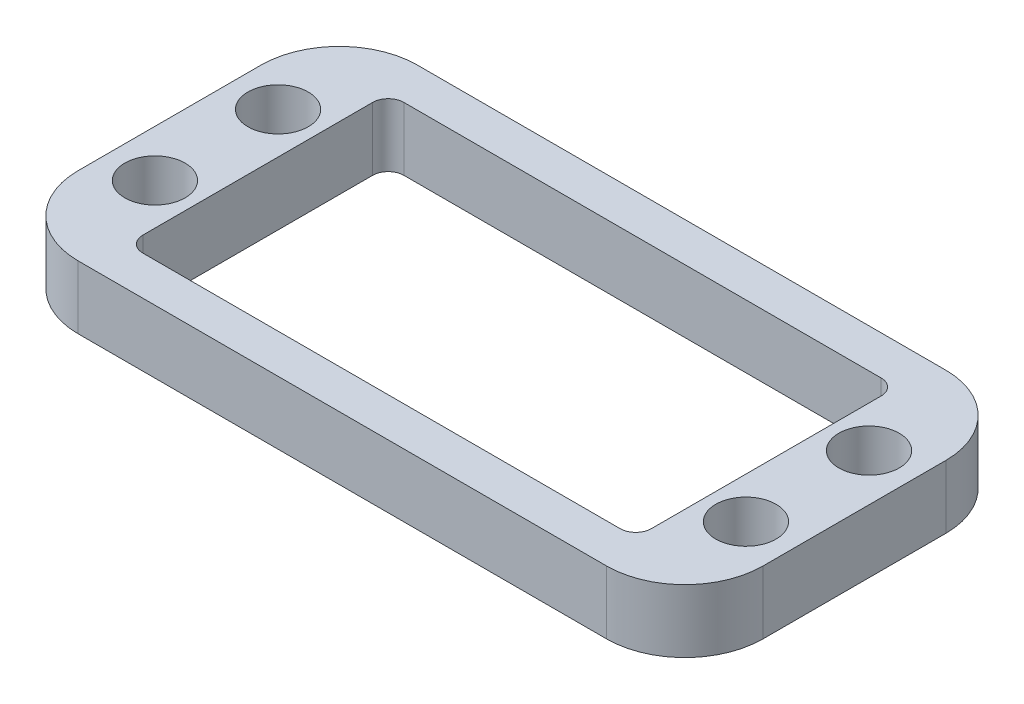
ISO-10303-21;
HEADER;
FILE_DESCRIPTION(('STEP AP214'),'2;1');
FILE_NAME('part.step','',(''),(''),'','','');
FILE_SCHEMA(('AUTOMOTIVE_DESIGN { 1 0 10303 214 1 1 1 1 }'));
ENDSEC;
DATA;
#1=APPLICATION_CONTEXT('core data for automotive mechanical design processes');
#2=APPLICATION_PROTOCOL_DEFINITION('international standard','automotive_design',2000,#1);
#3=PRODUCT_CONTEXT('',#1,'mechanical');
#4=PRODUCT('Part','Part','',(#3));
#5=PRODUCT_RELATED_PRODUCT_CATEGORY('part','',(#4));
#6=PRODUCT_DEFINITION_FORMATION('','',#4);
#7=PRODUCT_DEFINITION_CONTEXT('part definition',#1,'design');
#8=PRODUCT_DEFINITION('design','',#6,#7);
#9=PRODUCT_DEFINITION_SHAPE('','',#8);
#10=(LENGTH_UNIT() NAMED_UNIT(*) SI_UNIT(.MILLI.,.METRE.));
#11=(NAMED_UNIT(*) PLANE_ANGLE_UNIT() SI_UNIT($,.RADIAN.));
#12=(NAMED_UNIT(*) SI_UNIT($,.STERADIAN.) SOLID_ANGLE_UNIT());
#13=UNCERTAINTY_MEASURE_WITH_UNIT(LENGTH_MEASURE(1.E-05),#10,'distance_accuracy_value','');
#14=(GEOMETRIC_REPRESENTATION_CONTEXT(3) GLOBAL_UNCERTAINTY_ASSIGNED_CONTEXT((#13)) GLOBAL_UNIT_ASSIGNED_CONTEXT((#10,
#11,#12)) REPRESENTATION_CONTEXT('',''));
#15=CARTESIAN_POINT('',(0.,0.,0.));
#16=DIRECTION('',(0.,0.,1.));
#17=DIRECTION('',(1.,0.,0.));
#18=AXIS2_PLACEMENT_3D('',#15,#16,#17);
#19=CARTESIAN_POINT('',(0.,5.1308,0.));
#20=DIRECTION('',(0.,1.,0.));
#21=DIRECTION('',(0.,0.,1.));
#22=AXIS2_PLACEMENT_3D('',#19,#20,#21);
#23=PLANE('',#22);
#24=CARTESIAN_POINT('',(24.,5.1308,5.));
#25=DIRECTION('',(0.,1.,0.));
#26=DIRECTION('',(0.,0.,1.));
#27=AXIS2_PLACEMENT_3D('',#24,#25,#26);
#28=CIRCLE('',#27,2.45);
#29=CARTESIAN_POINT('',(24.,5.1308,7.45));
#30=VERTEX_POINT('',#29);
#31=EDGE_CURVE('E532',#30,#30,#28,.T.);
#32=ORIENTED_EDGE('',*,*,#31,.F.);
#33=EDGE_LOOP('',(#32));
#34=FACE_BOUND('',#33,.T.);
#35=CARTESIAN_POINT('',(-24.,5.1308,-5.));
#36=DIRECTION('',(0.,1.,0.));
#37=DIRECTION('',(0.,0.,1.));
#38=AXIS2_PLACEMENT_3D('',#35,#36,#37);
#39=CIRCLE('',#38,2.45);
#40=CARTESIAN_POINT('',(-24.,5.1308,-2.55));
#41=VERTEX_POINT('',#40);
#42=EDGE_CURVE('E534',#41,#41,#39,.T.);
#43=ORIENTED_EDGE('',*,*,#42,.F.);
#44=EDGE_LOOP('',(#43));
#45=FACE_BOUND('',#44,.T.);
#46=CARTESIAN_POINT('',(-24.,5.1308,5.));
#47=DIRECTION('',(0.,1.,0.));
#48=DIRECTION('',(0.,0.,1.));
#49=AXIS2_PLACEMENT_3D('',#46,#47,#48);
#50=CIRCLE('',#49,2.45);
#51=CARTESIAN_POINT('',(-24.,5.1308,7.45));
#52=VERTEX_POINT('',#51);
#53=EDGE_CURVE('E542',#52,#52,#50,.T.);
#54=ORIENTED_EDGE('',*,*,#53,.F.);
#55=EDGE_LOOP('',(#54));
#56=FACE_BOUND('',#55,.T.);
#57=CARTESIAN_POINT('',(24.,5.1308,-5.));
#58=DIRECTION('',(0.,1.,0.));
#59=DIRECTION('',(0.,0.,1.));
#60=AXIS2_PLACEMENT_3D('',#57,#58,#59);
#61=CIRCLE('',#60,2.45);
#62=CARTESIAN_POINT('',(24.,5.1308,-2.55));
#63=VERTEX_POINT('',#62);
#64=EDGE_CURVE('E548',#63,#63,#61,.T.);
#65=ORIENTED_EDGE('',*,*,#64,.F.);
#66=EDGE_LOOP('',(#65));
#67=FACE_BOUND('',#66,.T.);
#68=DIRECTION('',(1.,0.,0.));
#69=VECTOR('',#68,1.);
#70=CARTESIAN_POINT('',(-27.810000006,5.1308,13.775000009));
#71=LINE('',#70,#69);
#72=CARTESIAN_POINT('',(-21.460000006,5.1308,13.775000009));
#73=VERTEX_POINT('',#72);
#74=CARTESIAN_POINT('',(21.460000006,5.1308,13.775000009));
#75=VERTEX_POINT('',#74);
#76=EDGE_CURVE('E188',#73,#75,#71,.T.);
#77=ORIENTED_EDGE('',*,*,#76,.T.);
#78=CARTESIAN_POINT('',(21.460000006,5.1308,7.425000009));
#79=DIRECTION('',(0.,1.,0.));
#80=DIRECTION('',(0.,0.,1.));
#81=AXIS2_PLACEMENT_3D('',#78,#79,#80);
#82=CIRCLE('',#81,6.35);
#83=CARTESIAN_POINT('',(27.810000006,5.1308,7.425000009));
#84=VERTEX_POINT('',#83);
#85=EDGE_CURVE('E209',#75,#84,#82,.T.);
#86=ORIENTED_EDGE('',*,*,#85,.T.);
#87=DIRECTION('',(0.,0.,-1.));
#88=VECTOR('',#87,1.);
#89=CARTESIAN_POINT('',(27.810000006,5.1308,-13.775000009));
#90=LINE('',#89,#88);
#91=CARTESIAN_POINT('',(27.810000006,5.1308,-7.425000009));
#92=VERTEX_POINT('',#91);
#93=EDGE_CURVE('E171',#84,#92,#90,.T.);
#94=ORIENTED_EDGE('',*,*,#93,.T.);
#95=CARTESIAN_POINT('',(21.460000006,5.1308,-7.425000009));
#96=DIRECTION('',(0.,1.,0.));
#97=DIRECTION('',(0.,0.,1.));
#98=AXIS2_PLACEMENT_3D('',#95,#96,#97);
#99=CIRCLE('',#98,6.35);
#100=CARTESIAN_POINT('',(21.460000006,5.1308,-13.775000009));
#101=VERTEX_POINT('',#100);
#102=EDGE_CURVE('E207',#92,#101,#99,.T.);
#103=ORIENTED_EDGE('',*,*,#102,.T.);
#104=DIRECTION('',(-1.,0.,0.));
#105=VECTOR('',#104,1.);
#106=CARTESIAN_POINT('',(-27.810000006,5.1308,-13.775000009));
#107=LINE('',#106,#105);
#108=CARTESIAN_POINT('',(-21.460000006,5.1308,-13.775000009));
#109=VERTEX_POINT('',#108);
#110=EDGE_CURVE('E283',#101,#109,#107,.T.);
#111=ORIENTED_EDGE('',*,*,#110,.T.);
#112=CARTESIAN_POINT('',(-21.460000006,5.1308,-7.425000009));
#113=DIRECTION('',(0.,1.,0.));
#114=DIRECTION('',(0.,0.,1.));
#115=AXIS2_PLACEMENT_3D('',#112,#113,#114);
#116=CIRCLE('',#115,6.35);
#117=CARTESIAN_POINT('',(-27.810000006,5.1308,-7.425000009));
#118=VERTEX_POINT('',#117);
#119=EDGE_CURVE('E203',#109,#118,#116,.T.);
#120=ORIENTED_EDGE('',*,*,#119,.T.);
#121=DIRECTION('',(0.,0.,1.));
#122=VECTOR('',#121,1.);
#123=CARTESIAN_POINT('',(-27.810000006,5.1308,-13.775000009));
#124=LINE('',#123,#122);
#125=CARTESIAN_POINT('',(-27.810000006,5.1308,7.425000009));
#126=VERTEX_POINT('',#125);
#127=EDGE_CURVE('E285',#118,#126,#124,.T.);
#128=ORIENTED_EDGE('',*,*,#127,.T.);
#129=CARTESIAN_POINT('',(-21.460000006,5.1308,7.425000009));
#130=DIRECTION('',(0.,1.,0.));
#131=DIRECTION('',(0.,0.,1.));
#132=AXIS2_PLACEMENT_3D('',#129,#130,#131);
#133=CIRCLE('',#132,6.35);
#134=EDGE_CURVE('E205',#126,#73,#133,.T.);
#135=ORIENTED_EDGE('',*,*,#134,.T.);
#136=EDGE_LOOP('',(#77,#86,#94,#103,#111,#120,#128,#135));
#137=FACE_BOUND('',#136,.T.);
#138=DIRECTION('',(-1.,0.,0.));
#139=VECTOR('',#138,1.);
#140=CARTESIAN_POINT('',(-20.649999975,5.1308,-10.600000009));
#141=LINE('',#140,#139);
#142=CARTESIAN_POINT('',(19.379999975,5.1308,-10.600000009));
#143=VERTEX_POINT('',#142);
#144=CARTESIAN_POINT('',(-19.379999975,5.1308,-10.600000009));
#145=VERTEX_POINT('',#144);
#146=EDGE_CURVE('E267',#143,#145,#141,.T.);
#147=ORIENTED_EDGE('',*,*,#146,.F.);
#148=CARTESIAN_POINT('',(19.379999975,5.1308,-9.330000009));
#149=DIRECTION('',(0.,1.,0.));
#150=DIRECTION('',(0.,0.,1.));
#151=AXIS2_PLACEMENT_3D('',#148,#149,#150);
#152=CIRCLE('',#151,1.27);
#153=CARTESIAN_POINT('',(20.649999975,5.1308,-9.330000009));
#154=VERTEX_POINT('',#153);
#155=EDGE_CURVE('E250',#143,#154,#152,.F.);
#156=ORIENTED_EDGE('',*,*,#155,.T.);
#157=DIRECTION('',(0.,0.,-1.));
#158=VECTOR('',#157,1.);
#159=CARTESIAN_POINT('',(20.649999975,5.1308,-10.600000009));
#160=LINE('',#159,#158);
#161=CARTESIAN_POINT('',(20.649999975,5.1308,9.330000009));
#162=VERTEX_POINT('',#161);
#163=EDGE_CURVE('E269',#162,#154,#160,.T.);
#164=ORIENTED_EDGE('',*,*,#163,.F.);
#165=CARTESIAN_POINT('',(19.379999975,5.1308,9.330000009));
#166=DIRECTION('',(0.,1.,0.));
#167=DIRECTION('',(0.,0.,1.));
#168=AXIS2_PLACEMENT_3D('',#165,#166,#167);
#169=CIRCLE('',#168,1.27);
#170=CARTESIAN_POINT('',(19.379999975,5.1308,10.600000009));
#171=VERTEX_POINT('',#170);
#172=EDGE_CURVE('E246',#162,#171,#169,.F.);
#173=ORIENTED_EDGE('',*,*,#172,.T.);
#174=DIRECTION('',(1.,0.,0.));
#175=VECTOR('',#174,1.);
#176=CARTESIAN_POINT('',(-20.649999975,5.1308,10.600000009));
#177=LINE('',#176,#175);
#178=CARTESIAN_POINT('',(-19.379999975,5.1308,10.600000009));
#179=VERTEX_POINT('',#178);
#180=EDGE_CURVE('E179',#179,#171,#177,.T.);
#181=ORIENTED_EDGE('',*,*,#180,.F.);
#182=CARTESIAN_POINT('',(-19.379999975,5.1308,9.330000009));
#183=DIRECTION('',(0.,1.,0.));
#184=DIRECTION('',(0.,0.,1.));
#185=AXIS2_PLACEMENT_3D('',#182,#183,#184);
#186=CIRCLE('',#185,1.27);
#187=CARTESIAN_POINT('',(-20.649999975,5.1308,9.330000009));
#188=VERTEX_POINT('',#187);
#189=EDGE_CURVE('E242',#179,#188,#186,.F.);
#190=ORIENTED_EDGE('',*,*,#189,.T.);
#191=DIRECTION('',(0.,0.,1.));
#192=VECTOR('',#191,1.);
#193=CARTESIAN_POINT('',(-20.649999975,5.1308,-10.600000009));
#194=LINE('',#193,#192);
#195=CARTESIAN_POINT('',(-20.649999975,5.1308,-9.330000009));
#196=VERTEX_POINT('',#195);
#197=EDGE_CURVE('E185',#196,#188,#194,.T.);
#198=ORIENTED_EDGE('',*,*,#197,.F.);
#199=CARTESIAN_POINT('',(-19.379999975,5.1308,-9.330000009));
#200=DIRECTION('',(0.,1.,0.));
#201=DIRECTION('',(0.,0.,1.));
#202=AXIS2_PLACEMENT_3D('',#199,#200,#201);
#203=CIRCLE('',#202,1.27);
#204=EDGE_CURVE('E11',#196,#145,#203,.F.);
#205=ORIENTED_EDGE('',*,*,#204,.T.);
#206=EDGE_LOOP('',(#147,#156,#164,#173,#181,#190,#198,#205));
#207=FACE_BOUND('',#206,.T.);
#208=ADVANCED_FACE('F38',(#34,#45,#56,#67,#137,#207),#23,.T.);
#209=CARTESIAN_POINT('',(0.,0.,0.));
#210=DIRECTION('',(0.,1.,0.));
#211=DIRECTION('',(0.,0.,1.));
#212=AXIS2_PLACEMENT_3D('',#209,#210,#211);
#213=PLANE('',#212);
#214=CARTESIAN_POINT('',(24.,0.,5.));
#215=DIRECTION('',(0.,1.,0.));
#216=DIRECTION('',(0.,0.,1.));
#217=AXIS2_PLACEMENT_3D('',#214,#215,#216);
#218=CIRCLE('',#217,2.45);
#219=CARTESIAN_POINT('',(24.,0.,7.45));
#220=VERTEX_POINT('',#219);
#221=EDGE_CURVE('E530',#220,#220,#218,.T.);
#222=ORIENTED_EDGE('',*,*,#221,.T.);
#223=EDGE_LOOP('',(#222));
#224=FACE_BOUND('',#223,.T.);
#225=CARTESIAN_POINT('',(-24.,0.,-5.));
#226=DIRECTION('',(0.,1.,0.));
#227=DIRECTION('',(0.,0.,1.));
#228=AXIS2_PLACEMENT_3D('',#225,#226,#227);
#229=CIRCLE('',#228,2.45);
#230=CARTESIAN_POINT('',(-24.,0.,-2.55));
#231=VERTEX_POINT('',#230);
#232=EDGE_CURVE('E539',#231,#231,#229,.T.);
#233=ORIENTED_EDGE('',*,*,#232,.T.);
#234=EDGE_LOOP('',(#233));
#235=FACE_BOUND('',#234,.T.);
#236=CARTESIAN_POINT('',(-24.,0.,5.));
#237=DIRECTION('',(0.,1.,0.));
#238=DIRECTION('',(0.,0.,1.));
#239=AXIS2_PLACEMENT_3D('',#236,#237,#238);
#240=CIRCLE('',#239,2.45);
#241=CARTESIAN_POINT('',(-24.,0.,7.45));
#242=VERTEX_POINT('',#241);
#243=EDGE_CURVE('E545',#242,#242,#240,.T.);
#244=ORIENTED_EDGE('',*,*,#243,.T.);
#245=EDGE_LOOP('',(#244));
#246=FACE_BOUND('',#245,.T.);
#247=CARTESIAN_POINT('',(24.,0.,-5.));
#248=DIRECTION('',(0.,1.,0.));
#249=DIRECTION('',(0.,0.,1.));
#250=AXIS2_PLACEMENT_3D('',#247,#248,#249);
#251=CIRCLE('',#250,2.45);
#252=CARTESIAN_POINT('',(24.,0.,-2.55));
#253=VERTEX_POINT('',#252);
#254=EDGE_CURVE('E279',#253,#253,#251,.T.);
#255=ORIENTED_EDGE('',*,*,#254,.T.);
#256=EDGE_LOOP('',(#255));
#257=FACE_BOUND('',#256,.T.);
#258=DIRECTION('',(0.,0.,-1.));
#259=VECTOR('',#258,1.);
#260=CARTESIAN_POINT('',(27.810000006,0.,-13.775000009));
#261=LINE('',#260,#259);
#262=CARTESIAN_POINT('',(27.810000006,0.,7.425000009));
#263=VERTEX_POINT('',#262);
#264=CARTESIAN_POINT('',(27.810000006,0.,-7.425000009));
#265=VERTEX_POINT('',#264);
#266=EDGE_CURVE('E168',#263,#265,#261,.T.);
#267=ORIENTED_EDGE('',*,*,#266,.F.);
#268=CARTESIAN_POINT('',(21.460000006,0.,7.425000009));
#269=DIRECTION('',(0.,1.,0.));
#270=DIRECTION('',(0.,0.,1.));
#271=AXIS2_PLACEMENT_3D('',#268,#269,#270);
#272=CIRCLE('',#271,6.35);
#273=CARTESIAN_POINT('',(21.460000006,0.,13.775000009));
#274=VERTEX_POINT('',#273);
#275=EDGE_CURVE('E151',#263,#274,#272,.F.);
#276=ORIENTED_EDGE('',*,*,#275,.T.);
#277=DIRECTION('',(1.,0.,0.));
#278=VECTOR('',#277,1.);
#279=CARTESIAN_POINT('',(-27.810000006,0.,13.775000009));
#280=LINE('',#279,#278);
#281=CARTESIAN_POINT('',(-21.460000006,0.,13.775000009));
#282=VERTEX_POINT('',#281);
#283=EDGE_CURVE('E193',#282,#274,#280,.T.);
#284=ORIENTED_EDGE('',*,*,#283,.F.);
#285=CARTESIAN_POINT('',(-21.460000006,0.,7.425000009));
#286=DIRECTION('',(0.,1.,0.));
#287=DIRECTION('',(0.,0.,1.));
#288=AXIS2_PLACEMENT_3D('',#285,#286,#287);
#289=CIRCLE('',#288,6.35);
#290=CARTESIAN_POINT('',(-27.810000006,0.,7.425000009));
#291=VERTEX_POINT('',#290);
#292=EDGE_CURVE('E197',#282,#291,#289,.F.);
#293=ORIENTED_EDGE('',*,*,#292,.T.);
#294=DIRECTION('',(0.,0.,1.));
#295=VECTOR('',#294,1.);
#296=CARTESIAN_POINT('',(-27.810000006,0.,-13.775000009));
#297=LINE('',#296,#295);
#298=CARTESIAN_POINT('',(-27.810000006,0.,-7.425000009));
#299=VERTEX_POINT('',#298);
#300=EDGE_CURVE('E182',#299,#291,#297,.T.);
#301=ORIENTED_EDGE('',*,*,#300,.F.);
#302=CARTESIAN_POINT('',(-21.460000006,0.,-7.425000009));
#303=DIRECTION('',(0.,1.,0.));
#304=DIRECTION('',(0.,0.,1.));
#305=AXIS2_PLACEMENT_3D('',#302,#303,#304);
#306=CIRCLE('',#305,6.35);
#307=CARTESIAN_POINT('',(-21.460000006,0.,-13.775000009));
#308=VERTEX_POINT('',#307);
#309=EDGE_CURVE('E172',#299,#308,#306,.F.);
#310=ORIENTED_EDGE('',*,*,#309,.T.);
#311=DIRECTION('',(-1.,0.,0.));
#312=VECTOR('',#311,1.);
#313=CARTESIAN_POINT('',(-27.810000006,0.,-13.775000009));
#314=LINE('',#313,#312);
#315=CARTESIAN_POINT('',(21.460000006,0.,-13.775000009));
#316=VERTEX_POINT('',#315);
#317=EDGE_CURVE('E178',#316,#308,#314,.T.);
#318=ORIENTED_EDGE('',*,*,#317,.F.);
#319=CARTESIAN_POINT('',(21.460000006,0.,-7.425000009));
#320=DIRECTION('',(0.,1.,0.));
#321=DIRECTION('',(0.,0.,1.));
#322=AXIS2_PLACEMENT_3D('',#319,#320,#321);
#323=CIRCLE('',#322,6.35);
#324=EDGE_CURVE('E162',#316,#265,#323,.F.);
#325=ORIENTED_EDGE('',*,*,#324,.T.);
#326=EDGE_LOOP('',(#267,#276,#284,#293,#301,#310,#318,#325));
#327=FACE_BOUND('',#326,.T.);
#328=DIRECTION('',(1.,0.,0.));
#329=VECTOR('',#328,1.);
#330=CARTESIAN_POINT('',(-20.649999975,0.,10.600000009));
#331=LINE('',#330,#329);
#332=CARTESIAN_POINT('',(-19.379999975,0.,10.600000009));
#333=VERTEX_POINT('',#332);
#334=CARTESIAN_POINT('',(19.379999975,0.,10.600000009));
#335=VERTEX_POINT('',#334);
#336=EDGE_CURVE('E264',#333,#335,#331,.T.);
#337=ORIENTED_EDGE('',*,*,#336,.T.);
#338=CARTESIAN_POINT('',(19.379999975,0.,9.330000009));
#339=DIRECTION('',(0.,1.,0.));
#340=DIRECTION('',(0.,0.,1.));
#341=AXIS2_PLACEMENT_3D('',#338,#339,#340);
#342=CIRCLE('',#341,1.27);
#343=CARTESIAN_POINT('',(20.649999975,0.,9.330000009));
#344=VERTEX_POINT('',#343);
#345=EDGE_CURVE('E244',#335,#344,#342,.T.);
#346=ORIENTED_EDGE('',*,*,#345,.T.);
#347=DIRECTION('',(0.,0.,-1.));
#348=VECTOR('',#347,1.);
#349=CARTESIAN_POINT('',(20.649999975,0.,-10.600000009));
#350=LINE('',#349,#348);
#351=CARTESIAN_POINT('',(20.649999975,0.,-9.330000009));
#352=VERTEX_POINT('',#351);
#353=EDGE_CURVE('E276',#344,#352,#350,.T.);
#354=ORIENTED_EDGE('',*,*,#353,.T.);
#355=CARTESIAN_POINT('',(19.379999975,0.,-9.330000009));
#356=DIRECTION('',(0.,1.,0.));
#357=DIRECTION('',(0.,0.,1.));
#358=AXIS2_PLACEMENT_3D('',#355,#356,#357);
#359=CIRCLE('',#358,1.27);
#360=CARTESIAN_POINT('',(19.379999975,0.,-10.600000009));
#361=VERTEX_POINT('',#360);
#362=EDGE_CURVE('E248',#352,#361,#359,.T.);
#363=ORIENTED_EDGE('',*,*,#362,.T.);
#364=DIRECTION('',(-1.,0.,0.));
#365=VECTOR('',#364,1.);
#366=CARTESIAN_POINT('',(-20.649999975,0.,-10.600000009));
#367=LINE('',#366,#365);
#368=CARTESIAN_POINT('',(-19.379999975,0.,-10.600000009));
#369=VERTEX_POINT('',#368);
#370=EDGE_CURVE('E256',#361,#369,#367,.T.);
#371=ORIENTED_EDGE('',*,*,#370,.T.);
#372=CARTESIAN_POINT('',(-19.379999975,0.,-9.330000009));
#373=DIRECTION('',(0.,1.,0.));
#374=DIRECTION('',(0.,0.,1.));
#375=AXIS2_PLACEMENT_3D('',#372,#373,#374);
#376=CIRCLE('',#375,1.27);
#377=CARTESIAN_POINT('',(-20.649999975,0.,-9.330000009));
#378=VERTEX_POINT('',#377);
#379=EDGE_CURVE('E46',#369,#378,#376,.T.);
#380=ORIENTED_EDGE('',*,*,#379,.T.);
#381=DIRECTION('',(0.,0.,1.));
#382=VECTOR('',#381,1.);
#383=CARTESIAN_POINT('',(-20.649999975,0.,-10.600000009));
#384=LINE('',#383,#382);
#385=CARTESIAN_POINT('',(-20.649999975,0.,9.330000009));
#386=VERTEX_POINT('',#385);
#387=EDGE_CURVE('E255',#378,#386,#384,.T.);
#388=ORIENTED_EDGE('',*,*,#387,.T.);
#389=CARTESIAN_POINT('',(-19.379999975,0.,9.330000009));
#390=DIRECTION('',(0.,1.,0.));
#391=DIRECTION('',(0.,0.,1.));
#392=AXIS2_PLACEMENT_3D('',#389,#390,#391);
#393=CIRCLE('',#392,1.27);
#394=EDGE_CURVE('E240',#386,#333,#393,.T.);
#395=ORIENTED_EDGE('',*,*,#394,.T.);
#396=EDGE_LOOP('',(#337,#346,#354,#363,#371,#380,#388,#395));
#397=FACE_BOUND('',#396,.T.);
#398=ADVANCED_FACE('F175',(#224,#235,#246,#257,#327,#397),#213,.F.);
#399=CARTESIAN_POINT('',(27.810000006,5.1308,-13.775000009));
#400=DIRECTION('',(-1.,0.,0.));
#401=DIRECTION('',(0.,0.,1.));
#402=AXIS2_PLACEMENT_3D('',#399,#400,#401);
#403=PLANE('',#402);
#404=ORIENTED_EDGE('',*,*,#93,.F.);
#405=DIRECTION('',(0.,-1.,0.));
#406=VECTOR('',#405,1.);
#407=CARTESIAN_POINT('',(27.810000006,5.1308,7.425000009));
#408=LINE('',#407,#406);
#409=EDGE_CURVE('E155',#84,#263,#408,.T.);
#410=ORIENTED_EDGE('',*,*,#409,.T.);
#411=ORIENTED_EDGE('',*,*,#266,.T.);
#412=DIRECTION('',(0.,-1.,0.));
#413=VECTOR('',#412,1.);
#414=CARTESIAN_POINT('',(27.810000006,5.1308,-7.425000009));
#415=LINE('',#414,#413);
#416=EDGE_CURVE('E173',#265,#92,#415,.F.);
#417=ORIENTED_EDGE('',*,*,#416,.T.);
#418=EDGE_LOOP('',(#404,#410,#411,#417));
#419=FACE_BOUND('',#418,.T.);
#420=ADVANCED_FACE('F167',(#419),#403,.F.);
#421=CARTESIAN_POINT('',(-27.810000006,5.1308,-13.775000009));
#422=DIRECTION('',(0.,0.,1.));
#423=DIRECTION('',(1.,0.,0.));
#424=AXIS2_PLACEMENT_3D('',#421,#422,#423);
#425=PLANE('',#424);
#426=ORIENTED_EDGE('',*,*,#110,.F.);
#427=DIRECTION('',(0.,-1.,0.));
#428=VECTOR('',#427,1.);
#429=CARTESIAN_POINT('',(21.460000006,5.1308,-13.775000009));
#430=LINE('',#429,#428);
#431=EDGE_CURVE('E213',#101,#316,#430,.T.);
#432=ORIENTED_EDGE('',*,*,#431,.T.);
#433=ORIENTED_EDGE('',*,*,#317,.T.);
#434=DIRECTION('',(0.,-1.,0.));
#435=VECTOR('',#434,1.);
#436=CARTESIAN_POINT('',(-21.460000006,5.1308,-13.775000009));
#437=LINE('',#436,#435);
#438=EDGE_CURVE('E211',#308,#109,#437,.F.);
#439=ORIENTED_EDGE('',*,*,#438,.T.);
#440=EDGE_LOOP('',(#426,#432,#433,#439));
#441=FACE_BOUND('',#440,.T.);
#442=ADVANCED_FACE('F308',(#441),#425,.F.);
#443=CARTESIAN_POINT('',(-27.810000006,5.1308,-13.775000009));
#444=DIRECTION('',(1.,0.,0.));
#445=DIRECTION('',(0.,0.,-1.));
#446=AXIS2_PLACEMENT_3D('',#443,#444,#445);
#447=PLANE('',#446);
#448=ORIENTED_EDGE('',*,*,#300,.T.);
#449=DIRECTION('',(0.,-1.,0.));
#450=VECTOR('',#449,1.);
#451=CARTESIAN_POINT('',(-27.810000006,5.1308,7.425000009));
#452=LINE('',#451,#450);
#453=EDGE_CURVE('E219',#291,#126,#452,.F.);
#454=ORIENTED_EDGE('',*,*,#453,.T.);
#455=ORIENTED_EDGE('',*,*,#127,.F.);
#456=DIRECTION('',(0.,-1.,0.));
#457=VECTOR('',#456,1.);
#458=CARTESIAN_POINT('',(-27.810000006,5.1308,-7.425000009));
#459=LINE('',#458,#457);
#460=EDGE_CURVE('E216',#118,#299,#459,.T.);
#461=ORIENTED_EDGE('',*,*,#460,.T.);
#462=EDGE_LOOP('',(#448,#454,#455,#461));
#463=FACE_BOUND('',#462,.T.);
#464=ADVANCED_FACE('F300',(#463),#447,.F.);
#465=CARTESIAN_POINT('',(-27.810000006,5.1308,13.775000009));
#466=DIRECTION('',(0.,0.,-1.));
#467=DIRECTION('',(-1.,0.,0.));
#468=AXIS2_PLACEMENT_3D('',#465,#466,#467);
#469=PLANE('',#468);
#470=ORIENTED_EDGE('',*,*,#283,.T.);
#471=DIRECTION('',(0.,-1.,0.));
#472=VECTOR('',#471,1.);
#473=CARTESIAN_POINT('',(21.460000006,5.1308,13.775000009));
#474=LINE('',#473,#472);
#475=EDGE_CURVE('E156',#274,#75,#474,.F.);
#476=ORIENTED_EDGE('',*,*,#475,.T.);
#477=ORIENTED_EDGE('',*,*,#76,.F.);
#478=DIRECTION('',(0.,-1.,0.));
#479=VECTOR('',#478,1.);
#480=CARTESIAN_POINT('',(-21.460000006,5.1308,13.775000009));
#481=LINE('',#480,#479);
#482=EDGE_CURVE('E161',#73,#282,#481,.T.);
#483=ORIENTED_EDGE('',*,*,#482,.T.);
#484=EDGE_LOOP('',(#470,#476,#477,#483));
#485=FACE_BOUND('',#484,.T.);
#486=ADVANCED_FACE('F294',(#485),#469,.F.);
#487=CARTESIAN_POINT('',(20.649999975,5.1308,-10.600000009));
#488=DIRECTION('',(-1.,0.,0.));
#489=DIRECTION('',(0.,0.,1.));
#490=AXIS2_PLACEMENT_3D('',#487,#488,#489);
#491=PLANE('',#490);
#492=ORIENTED_EDGE('',*,*,#353,.F.);
#493=DIRECTION('',(0.,-1.,0.));
#494=VECTOR('',#493,1.);
#495=CARTESIAN_POINT('',(20.649999975,5.1308,9.330000009));
#496=LINE('',#495,#494);
#497=EDGE_CURVE('E234',#344,#162,#496,.F.);
#498=ORIENTED_EDGE('',*,*,#497,.T.);
#499=ORIENTED_EDGE('',*,*,#163,.T.);
#500=DIRECTION('',(0.,-1.,0.));
#501=VECTOR('',#500,1.);
#502=CARTESIAN_POINT('',(20.649999975,0.,-9.330000009));
#503=LINE('',#502,#501);
#504=EDGE_CURVE('E231',#154,#352,#503,.T.);
#505=ORIENTED_EDGE('',*,*,#504,.T.);
#506=EDGE_LOOP('',(#492,#498,#499,#505));
#507=FACE_BOUND('',#506,.T.);
#508=ADVANCED_FACE('F333',(#507),#491,.T.);
#509=CARTESIAN_POINT('',(-20.649999975,5.1308,-10.600000009));
#510=DIRECTION('',(0.,0.,1.));
#511=DIRECTION('',(1.,0.,0.));
#512=AXIS2_PLACEMENT_3D('',#509,#510,#511);
#513=PLANE('',#512);
#514=ORIENTED_EDGE('',*,*,#370,.F.);
#515=DIRECTION('',(0.,-1.,0.));
#516=VECTOR('',#515,1.);
#517=CARTESIAN_POINT('',(19.379999975,5.1308,-10.600000009));
#518=LINE('',#517,#516);
#519=EDGE_CURVE('E58',#361,#143,#518,.F.);
#520=ORIENTED_EDGE('',*,*,#519,.T.);
#521=ORIENTED_EDGE('',*,*,#146,.T.);
#522=DIRECTION('',(0.,-1.,0.));
#523=VECTOR('',#522,1.);
#524=CARTESIAN_POINT('',(-19.379999975,0.,-10.600000009));
#525=LINE('',#524,#523);
#526=EDGE_CURVE('E236',#145,#369,#525,.T.);
#527=ORIENTED_EDGE('',*,*,#526,.T.);
#528=EDGE_LOOP('',(#514,#520,#521,#527));
#529=FACE_BOUND('',#528,.T.);
#530=ADVANCED_FACE('F266',(#529),#513,.T.);
#531=CARTESIAN_POINT('',(-20.649999975,5.1308,-10.600000009));
#532=DIRECTION('',(1.,0.,0.));
#533=DIRECTION('',(0.,0.,-1.));
#534=AXIS2_PLACEMENT_3D('',#531,#532,#533);
#535=PLANE('',#534);
#536=ORIENTED_EDGE('',*,*,#197,.T.);
#537=DIRECTION('',(0.,-1.,0.));
#538=VECTOR('',#537,1.);
#539=CARTESIAN_POINT('',(-20.649999975,0.,9.330000009));
#540=LINE('',#539,#538);
#541=EDGE_CURVE('E223',#188,#386,#540,.T.);
#542=ORIENTED_EDGE('',*,*,#541,.T.);
#543=ORIENTED_EDGE('',*,*,#387,.F.);
#544=DIRECTION('',(0.,-1.,0.));
#545=VECTOR('',#544,1.);
#546=CARTESIAN_POINT('',(-20.649999975,5.1308,-9.330000009));
#547=LINE('',#546,#545);
#548=EDGE_CURVE('E221',#378,#196,#547,.F.);
#549=ORIENTED_EDGE('',*,*,#548,.T.);
#550=EDGE_LOOP('',(#536,#542,#543,#549));
#551=FACE_BOUND('',#550,.T.);
#552=ADVANCED_FACE('F262',(#551),#535,.T.);
#553=CARTESIAN_POINT('',(-20.649999975,5.1308,10.600000009));
#554=DIRECTION('',(0.,0.,-1.));
#555=DIRECTION('',(-1.,0.,0.));
#556=AXIS2_PLACEMENT_3D('',#553,#554,#555);
#557=PLANE('',#556);
#558=ORIENTED_EDGE('',*,*,#336,.F.);
#559=DIRECTION('',(0.,-1.,0.));
#560=VECTOR('',#559,1.);
#561=CARTESIAN_POINT('',(-19.379999975,5.1308,10.600000009));
#562=LINE('',#561,#560);
#563=EDGE_CURVE('E229',#333,#179,#562,.F.);
#564=ORIENTED_EDGE('',*,*,#563,.T.);
#565=ORIENTED_EDGE('',*,*,#180,.T.);
#566=DIRECTION('',(0.,-1.,0.));
#567=VECTOR('',#566,1.);
#568=CARTESIAN_POINT('',(19.379999975,0.,10.600000009));
#569=LINE('',#568,#567);
#570=EDGE_CURVE('E226',#171,#335,#569,.T.);
#571=ORIENTED_EDGE('',*,*,#570,.T.);
#572=EDGE_LOOP('',(#558,#564,#565,#571));
#573=FACE_BOUND('',#572,.T.);
#574=ADVANCED_FACE('F378',(#573),#557,.T.);
#575=CARTESIAN_POINT('',(24.,5.1308,-5.));
#576=DIRECTION('',(0.,1.,0.));
#577=DIRECTION('',(0.,0.,1.));
#578=AXIS2_PLACEMENT_3D('',#575,#576,#577);
#579=CYLINDRICAL_SURFACE('',#578,2.45);
#580=ORIENTED_EDGE('',*,*,#254,.F.);
#581=EDGE_LOOP('',(#580));
#582=FACE_BOUND('',#581,.T.);
#583=ORIENTED_EDGE('',*,*,#64,.T.);
#584=EDGE_LOOP('',(#583));
#585=FACE_BOUND('',#584,.T.);
#586=ADVANCED_FACE('F385',(#582,#585),#579,.F.);
#587=CARTESIAN_POINT('',(-24.,5.1308,5.));
#588=DIRECTION('',(0.,1.,0.));
#589=DIRECTION('',(0.,0.,1.));
#590=AXIS2_PLACEMENT_3D('',#587,#588,#589);
#591=CYLINDRICAL_SURFACE('',#590,2.45);
#592=ORIENTED_EDGE('',*,*,#243,.F.);
#593=EDGE_LOOP('',(#592));
#594=FACE_BOUND('',#593,.T.);
#595=ORIENTED_EDGE('',*,*,#53,.T.);
#596=EDGE_LOOP('',(#595));
#597=FACE_BOUND('',#596,.T.);
#598=ADVANCED_FACE('F394',(#594,#597),#591,.F.);
#599=CARTESIAN_POINT('',(-24.,5.1308,-5.));
#600=DIRECTION('',(0.,1.,0.));
#601=DIRECTION('',(0.,0.,1.));
#602=AXIS2_PLACEMENT_3D('',#599,#600,#601);
#603=CYLINDRICAL_SURFACE('',#602,2.45);
#604=ORIENTED_EDGE('',*,*,#232,.F.);
#605=EDGE_LOOP('',(#604));
#606=FACE_BOUND('',#605,.T.);
#607=ORIENTED_EDGE('',*,*,#42,.T.);
#608=EDGE_LOOP('',(#607));
#609=FACE_BOUND('',#608,.T.);
#610=ADVANCED_FACE('F402',(#606,#609),#603,.F.);
#611=CARTESIAN_POINT('',(24.,5.1308,5.));
#612=DIRECTION('',(0.,1.,0.));
#613=DIRECTION('',(0.,0.,1.));
#614=AXIS2_PLACEMENT_3D('',#611,#612,#613);
#615=CYLINDRICAL_SURFACE('',#614,2.45);
#616=ORIENTED_EDGE('',*,*,#221,.F.);
#617=EDGE_LOOP('',(#616));
#618=FACE_BOUND('',#617,.T.);
#619=ORIENTED_EDGE('',*,*,#31,.T.);
#620=EDGE_LOOP('',(#619));
#621=FACE_BOUND('',#620,.T.);
#622=ADVANCED_FACE('F320',(#618,#621),#615,.F.);
#623=CARTESIAN_POINT('',(21.460000006,5.1308,7.425000009));
#624=DIRECTION('',(0.,-1.,0.));
#625=DIRECTION('',(0.,0.,-1.));
#626=AXIS2_PLACEMENT_3D('',#623,#624,#625);
#627=CYLINDRICAL_SURFACE('',#626,6.35);
#628=ORIENTED_EDGE('',*,*,#85,.F.);
#629=ORIENTED_EDGE('',*,*,#475,.F.);
#630=ORIENTED_EDGE('',*,*,#275,.F.);
#631=ORIENTED_EDGE('',*,*,#409,.F.);
#632=EDGE_LOOP('',(#628,#629,#630,#631));
#633=FACE_BOUND('',#632,.T.);
#634=ADVANCED_FACE('F154',(#633),#627,.T.);
#635=CARTESIAN_POINT('',(21.460000006,5.1308,-7.425000009));
#636=DIRECTION('',(0.,-1.,0.));
#637=DIRECTION('',(0.,0.,-1.));
#638=AXIS2_PLACEMENT_3D('',#635,#636,#637);
#639=CYLINDRICAL_SURFACE('',#638,6.35);
#640=ORIENTED_EDGE('',*,*,#102,.F.);
#641=ORIENTED_EDGE('',*,*,#416,.F.);
#642=ORIENTED_EDGE('',*,*,#324,.F.);
#643=ORIENTED_EDGE('',*,*,#431,.F.);
#644=EDGE_LOOP('',(#640,#641,#642,#643));
#645=FACE_BOUND('',#644,.T.);
#646=ADVANCED_FACE('F312',(#645),#639,.T.);
#647=CARTESIAN_POINT('',(-21.460000006,5.1308,7.425000009));
#648=DIRECTION('',(0.,-1.,0.));
#649=DIRECTION('',(0.,0.,-1.));
#650=AXIS2_PLACEMENT_3D('',#647,#648,#649);
#651=CYLINDRICAL_SURFACE('',#650,6.35);
#652=ORIENTED_EDGE('',*,*,#134,.F.);
#653=ORIENTED_EDGE('',*,*,#453,.F.);
#654=ORIENTED_EDGE('',*,*,#292,.F.);
#655=ORIENTED_EDGE('',*,*,#482,.F.);
#656=EDGE_LOOP('',(#652,#653,#654,#655));
#657=FACE_BOUND('',#656,.T.);
#658=ADVANCED_FACE('F296',(#657),#651,.T.);
#659=CARTESIAN_POINT('',(-21.460000006,5.1308,-7.425000009));
#660=DIRECTION('',(0.,-1.,0.));
#661=DIRECTION('',(0.,0.,-1.));
#662=AXIS2_PLACEMENT_3D('',#659,#660,#661);
#663=CYLINDRICAL_SURFACE('',#662,6.35);
#664=ORIENTED_EDGE('',*,*,#119,.F.);
#665=ORIENTED_EDGE('',*,*,#438,.F.);
#666=ORIENTED_EDGE('',*,*,#309,.F.);
#667=ORIENTED_EDGE('',*,*,#460,.F.);
#668=EDGE_LOOP('',(#664,#665,#666,#667));
#669=FACE_BOUND('',#668,.T.);
#670=ADVANCED_FACE('F304',(#669),#663,.T.);
#671=CARTESIAN_POINT('',(-19.379999975,5.1308,9.330000009));
#672=DIRECTION('',(0.,1.,0.));
#673=DIRECTION('',(0.,0.,1.));
#674=AXIS2_PLACEMENT_3D('',#671,#672,#673);
#675=CYLINDRICAL_SURFACE('',#674,1.27);
#676=ORIENTED_EDGE('',*,*,#189,.F.);
#677=ORIENTED_EDGE('',*,*,#563,.F.);
#678=ORIENTED_EDGE('',*,*,#394,.F.);
#679=ORIENTED_EDGE('',*,*,#541,.F.);
#680=EDGE_LOOP('',(#676,#677,#678,#679));
#681=FACE_BOUND('',#680,.T.);
#682=ADVANCED_FACE('F439',(#681),#675,.F.);
#683=CARTESIAN_POINT('',(19.379999975,5.1308,9.330000009));
#684=DIRECTION('',(0.,1.,0.));
#685=DIRECTION('',(0.,0.,1.));
#686=AXIS2_PLACEMENT_3D('',#683,#684,#685);
#687=CYLINDRICAL_SURFACE('',#686,1.27);
#688=ORIENTED_EDGE('',*,*,#172,.F.);
#689=ORIENTED_EDGE('',*,*,#497,.F.);
#690=ORIENTED_EDGE('',*,*,#345,.F.);
#691=ORIENTED_EDGE('',*,*,#570,.F.);
#692=EDGE_LOOP('',(#688,#689,#690,#691));
#693=FACE_BOUND('',#692,.T.);
#694=ADVANCED_FACE('F487',(#693),#687,.F.);
#695=CARTESIAN_POINT('',(19.379999975,5.1308,-9.330000009));
#696=DIRECTION('',(0.,1.,0.));
#697=DIRECTION('',(0.,0.,1.));
#698=AXIS2_PLACEMENT_3D('',#695,#696,#697);
#699=CYLINDRICAL_SURFACE('',#698,1.27);
#700=ORIENTED_EDGE('',*,*,#155,.F.);
#701=ORIENTED_EDGE('',*,*,#519,.F.);
#702=ORIENTED_EDGE('',*,*,#362,.F.);
#703=ORIENTED_EDGE('',*,*,#504,.F.);
#704=EDGE_LOOP('',(#700,#701,#702,#703));
#705=FACE_BOUND('',#704,.T.);
#706=ADVANCED_FACE('F494',(#705),#699,.F.);
#707=CARTESIAN_POINT('',(-19.379999975,5.1308,-9.330000009));
#708=DIRECTION('',(0.,1.,0.));
#709=DIRECTION('',(0.,0.,1.));
#710=AXIS2_PLACEMENT_3D('',#707,#708,#709);
#711=CYLINDRICAL_SURFACE('',#710,1.27);
#712=ORIENTED_EDGE('',*,*,#204,.F.);
#713=ORIENTED_EDGE('',*,*,#548,.F.);
#714=ORIENTED_EDGE('',*,*,#379,.F.);
#715=ORIENTED_EDGE('',*,*,#526,.F.);
#716=EDGE_LOOP('',(#712,#713,#714,#715));
#717=FACE_BOUND('',#716,.T.);
#718=ADVANCED_FACE('F40',(#717),#711,.F.);
#719=CLOSED_SHELL('',(#208,#398,#420,#442,#464,#486,#508,#530,#552,#574,#586,#598,#610,#622,
#634,#646,#658,#670,#682,#694,#706,#718));
#720=MANIFOLD_SOLID_BREP('B2',#719);
#721=ADVANCED_BREP_SHAPE_REPRESENTATION('',(#18,#720),#14);
#722=SHAPE_DEFINITION_REPRESENTATION(#9,#721);
ENDSEC;
END-ISO-10303-21;
